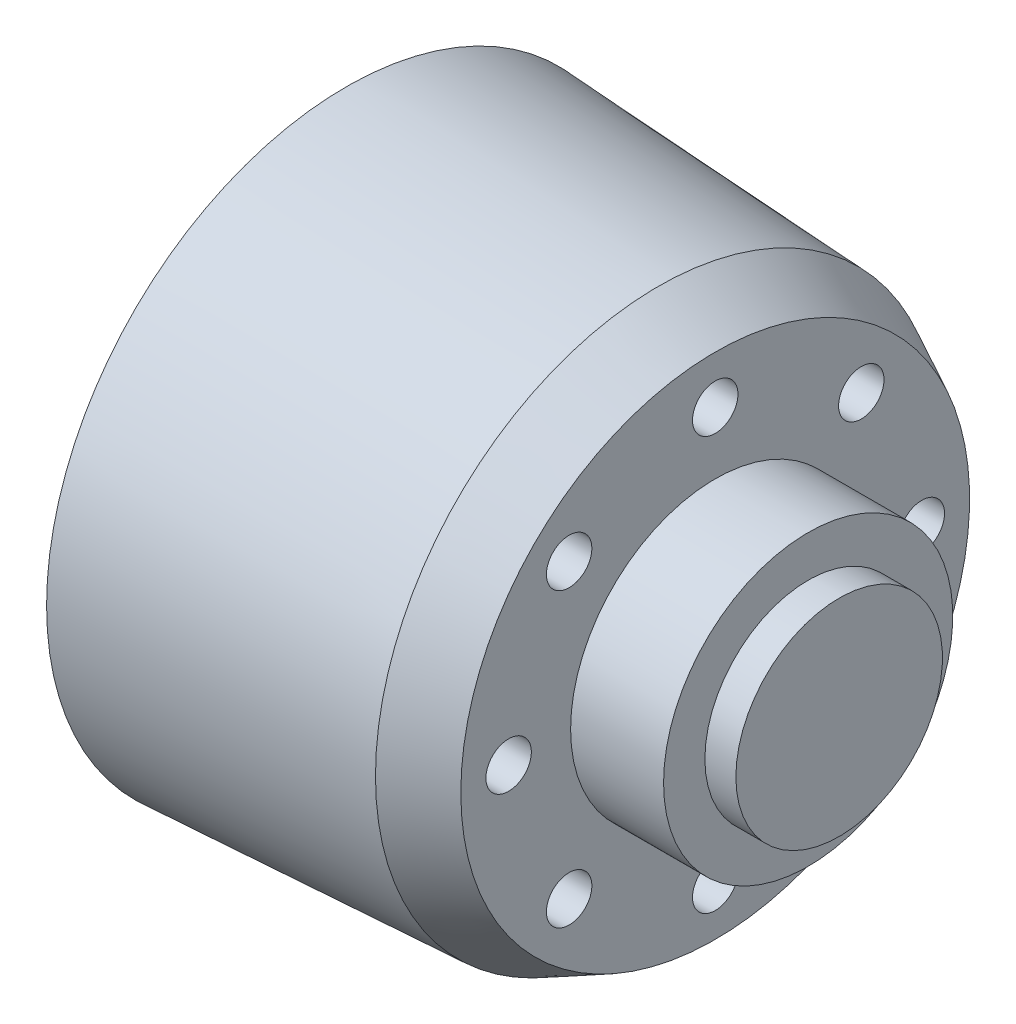
ISO-10303-21;
HEADER;
FILE_DESCRIPTION(('STEP AP214'),'2;1');
FILE_NAME('part.step','',(''),(''),'','','');
FILE_SCHEMA(('AUTOMOTIVE_DESIGN { 1 0 10303 214 1 1 1 1 }'));
ENDSEC;
DATA;
#1=APPLICATION_CONTEXT('core data for automotive mechanical design processes');
#2=APPLICATION_PROTOCOL_DEFINITION('international standard','automotive_design',2000,#1);
#3=PRODUCT_CONTEXT('',#1,'mechanical');
#4=PRODUCT('Part','Part','',(#3));
#5=PRODUCT_RELATED_PRODUCT_CATEGORY('part','',(#4));
#6=PRODUCT_DEFINITION_FORMATION('','',#4);
#7=PRODUCT_DEFINITION_CONTEXT('part definition',#1,'design');
#8=PRODUCT_DEFINITION('design','',#6,#7);
#9=PRODUCT_DEFINITION_SHAPE('','',#8);
#10=(LENGTH_UNIT() NAMED_UNIT(*) SI_UNIT(.MILLI.,.METRE.));
#11=(NAMED_UNIT(*) PLANE_ANGLE_UNIT() SI_UNIT($,.RADIAN.));
#12=(NAMED_UNIT(*) SI_UNIT($,.STERADIAN.) SOLID_ANGLE_UNIT());
#13=UNCERTAINTY_MEASURE_WITH_UNIT(LENGTH_MEASURE(1.E-05),#10,'distance_accuracy_value','');
#14=(GEOMETRIC_REPRESENTATION_CONTEXT(3) GLOBAL_UNCERTAINTY_ASSIGNED_CONTEXT((#13)) GLOBAL_UNIT_ASSIGNED_CONTEXT((#10,
#11,#12)) REPRESENTATION_CONTEXT('',''));
#15=CARTESIAN_POINT('',(0.,0.,0.));
#16=DIRECTION('',(0.,0.,1.));
#17=DIRECTION('',(1.,0.,0.));
#18=AXIS2_PLACEMENT_3D('',#15,#16,#17);
#19=CARTESIAN_POINT('',(-7.67303075194239,7.07106781186527,7.07106781186539));
#20=DIRECTION('',(1.,0.,0.));
#21=DIRECTION('',(0.,0.,-1.));
#22=AXIS2_PLACEMENT_3D('',#19,#20,#21);
#23=CYLINDRICAL_SURFACE('',#22,1.10000000000026);
#24=CARTESIAN_POINT('',(10.1938597161833,7.07106781186527,7.07106781186539));
#25=DIRECTION('',(1.,0.,0.));
#26=DIRECTION('',(0.,0.,-1.));
#27=AXIS2_PLACEMENT_3D('',#24,#25,#26);
#28=CIRCLE('',#27,1.10000000000026);
#29=CARTESIAN_POINT('',(10.1938597161833,7.07106781186527,5.97106781186514));
#30=VERTEX_POINT('',#29);
#31=EDGE_CURVE('E76',#30,#30,#28,.T.);
#32=ORIENTED_EDGE('',*,*,#31,.T.);
#33=EDGE_LOOP('',(#32));
#34=FACE_BOUND('',#33,.T.);
#35=CARTESIAN_POINT('',(7.19385971618328,7.07106781186527,7.07106781186539));
#36=DIRECTION('',(-1.,0.,0.));
#37=DIRECTION('',(0.,0.,1.));
#38=AXIS2_PLACEMENT_3D('',#35,#36,#37);
#39=CIRCLE('',#38,1.10000000000026);
#40=CARTESIAN_POINT('',(7.19385971618328,7.07106781186527,8.17106781186565));
#41=VERTEX_POINT('',#40);
#42=EDGE_CURVE('E40',#41,#41,#39,.F.);
#43=ORIENTED_EDGE('',*,*,#42,.F.);
#44=EDGE_LOOP('',(#43));
#45=FACE_BOUND('',#44,.T.);
#46=ADVANCED_FACE('F36',(#34,#45),#23,.F.);
#47=CARTESIAN_POINT('',(-7.67303075194239,-2.83604770904466E-13,9.99999999999972));
#48=DIRECTION('',(1.,0.,0.));
#49=DIRECTION('',(0.,0.,-1.));
#50=AXIS2_PLACEMENT_3D('',#47,#48,#49);
#51=CYLINDRICAL_SURFACE('',#50,1.10000000000045);
#52=CARTESIAN_POINT('',(10.1938597161833,-2.83604770904466E-13,9.99999999999972));
#53=DIRECTION('',(1.,0.,0.));
#54=DIRECTION('',(0.,0.,-1.));
#55=AXIS2_PLACEMENT_3D('',#52,#53,#54);
#56=CIRCLE('',#55,1.10000000000045);
#57=CARTESIAN_POINT('',(10.1938597161833,-2.83604770904466E-13,8.89999999999927));
#58=VERTEX_POINT('',#57);
#59=EDGE_CURVE('E80',#58,#58,#56,.T.);
#60=ORIENTED_EDGE('',*,*,#59,.T.);
#61=EDGE_LOOP('',(#60));
#62=FACE_BOUND('',#61,.T.);
#63=CARTESIAN_POINT('',(7.19385971618328,-2.83604770904466E-13,9.99999999999972));
#64=DIRECTION('',(-1.,0.,0.));
#65=DIRECTION('',(0.,0.,1.));
#66=AXIS2_PLACEMENT_3D('',#63,#64,#65);
#67=CIRCLE('',#66,1.10000000000045);
#68=CARTESIAN_POINT('',(7.19385971618328,-2.83604770904466E-13,11.1000000000002));
#69=VERTEX_POINT('',#68);
#70=EDGE_CURVE('E71',#69,#69,#67,.F.);
#71=ORIENTED_EDGE('',*,*,#70,.F.);
#72=EDGE_LOOP('',(#71));
#73=FACE_BOUND('',#72,.T.);
#74=ADVANCED_FACE('F141',(#62,#73),#51,.F.);
#75=CARTESIAN_POINT('',(-7.67303075194239,-7.07106781186568,7.07106781186499));
#76=DIRECTION('',(1.,0.,0.));
#77=DIRECTION('',(0.,0.,-1.));
#78=AXIS2_PLACEMENT_3D('',#75,#76,#77);
#79=CYLINDRICAL_SURFACE('',#78,1.1000000000006);
#80=CARTESIAN_POINT('',(10.1938597161833,-7.07106781186568,7.07106781186499));
#81=DIRECTION('',(1.,0.,0.));
#82=DIRECTION('',(0.,0.,-1.));
#83=AXIS2_PLACEMENT_3D('',#80,#81,#82);
#84=CIRCLE('',#83,1.1000000000006);
#85=CARTESIAN_POINT('',(10.1938597161833,-7.07106781186568,5.97106781186439));
#86=VERTEX_POINT('',#85);
#87=EDGE_CURVE('E85',#86,#86,#84,.T.);
#88=ORIENTED_EDGE('',*,*,#87,.T.);
#89=EDGE_LOOP('',(#88));
#90=FACE_BOUND('',#89,.T.);
#91=CARTESIAN_POINT('',(7.19385971618328,-7.07106781186568,7.07106781186499));
#92=DIRECTION('',(-1.,0.,0.));
#93=DIRECTION('',(0.,0.,1.));
#94=AXIS2_PLACEMENT_3D('',#91,#92,#93);
#95=CIRCLE('',#94,1.1000000000006);
#96=CARTESIAN_POINT('',(7.19385971618328,-7.07106781186568,8.1710678118656));
#97=VERTEX_POINT('',#96);
#98=EDGE_CURVE('E69',#97,#97,#95,.F.);
#99=ORIENTED_EDGE('',*,*,#98,.F.);
#100=EDGE_LOOP('',(#99));
#101=FACE_BOUND('',#100,.T.);
#102=ADVANCED_FACE('F146',(#90,#101),#79,.F.);
#103=CARTESIAN_POINT('',(-7.67303075194239,-10.,-5.64760248210638E-13));
#104=DIRECTION('',(1.,0.,0.));
#105=DIRECTION('',(0.,0.,-1.));
#106=AXIS2_PLACEMENT_3D('',#103,#104,#105);
#107=CYLINDRICAL_SURFACE('',#106,1.10000000000061);
#108=CARTESIAN_POINT('',(10.1938597161833,-10.,-5.64760248210638E-13));
#109=DIRECTION('',(1.,0.,0.));
#110=DIRECTION('',(0.,0.,-1.));
#111=AXIS2_PLACEMENT_3D('',#108,#109,#110);
#112=CIRCLE('',#111,1.10000000000061);
#113=CARTESIAN_POINT('',(10.1938597161833,-10.,-1.10000000000117));
#114=VERTEX_POINT('',#113);
#115=EDGE_CURVE('E477',#114,#114,#112,.T.);
#116=ORIENTED_EDGE('',*,*,#115,.T.);
#117=EDGE_LOOP('',(#116));
#118=FACE_BOUND('',#117,.T.);
#119=CARTESIAN_POINT('',(7.19385971618328,-10.,-5.64760248210638E-13));
#120=DIRECTION('',(-1.,0.,0.));
#121=DIRECTION('',(0.,0.,1.));
#122=AXIS2_PLACEMENT_3D('',#119,#120,#121);
#123=CIRCLE('',#122,1.10000000000061);
#124=CARTESIAN_POINT('',(7.19385971618328,-10.,1.10000000000004));
#125=VERTEX_POINT('',#124);
#126=EDGE_CURVE('E66',#125,#125,#123,.F.);
#127=ORIENTED_EDGE('',*,*,#126,.F.);
#128=EDGE_LOOP('',(#127));
#129=FACE_BOUND('',#128,.T.);
#130=ADVANCED_FACE('F346',(#118,#129),#107,.F.);
#131=CARTESIAN_POINT('',(-7.67303075194239,-7.07106781186527,-7.07106781186596));
#132=DIRECTION('',(1.,0.,0.));
#133=DIRECTION('',(0.,0.,-1.));
#134=AXIS2_PLACEMENT_3D('',#131,#132,#133);
#135=CYLINDRICAL_SURFACE('',#134,1.10000000000045);
#136=CARTESIAN_POINT('',(10.1938597161833,-7.07106781186527,-7.07106781186596));
#137=DIRECTION('',(1.,0.,0.));
#138=DIRECTION('',(0.,0.,-1.));
#139=AXIS2_PLACEMENT_3D('',#136,#137,#138);
#140=CIRCLE('',#139,1.10000000000045);
#141=CARTESIAN_POINT('',(10.1938597161833,-7.07106781186527,-8.17106781186641));
#142=VERTEX_POINT('',#141);
#143=EDGE_CURVE('E473',#142,#142,#140,.T.);
#144=ORIENTED_EDGE('',*,*,#143,.T.);
#145=EDGE_LOOP('',(#144));
#146=FACE_BOUND('',#145,.T.);
#147=CARTESIAN_POINT('',(7.19385971618328,-7.07106781186527,-7.07106781186596));
#148=DIRECTION('',(-1.,0.,0.));
#149=DIRECTION('',(0.,0.,1.));
#150=AXIS2_PLACEMENT_3D('',#147,#148,#149);
#151=CIRCLE('',#150,1.10000000000045);
#152=CARTESIAN_POINT('',(7.19385971618328,-7.07106781186527,-5.9710678118655));
#153=VERTEX_POINT('',#152);
#154=EDGE_CURVE('E63',#153,#153,#151,.F.);
#155=ORIENTED_EDGE('',*,*,#154,.F.);
#156=EDGE_LOOP('',(#155));
#157=FACE_BOUND('',#156,.T.);
#158=ADVANCED_FACE('F354',(#146,#157),#135,.F.);
#159=CARTESIAN_POINT('',(-7.67303075194239,2.82380124105319E-13,-10.0000000000003));
#160=DIRECTION('',(1.,0.,0.));
#161=DIRECTION('',(0.,0.,-1.));
#162=AXIS2_PLACEMENT_3D('',#159,#160,#161);
#163=CYLINDRICAL_SURFACE('',#162,1.10000000000022);
#164=CARTESIAN_POINT('',(10.1938597161833,2.82380124105319E-13,-10.0000000000003));
#165=DIRECTION('',(1.,0.,0.));
#166=DIRECTION('',(0.,0.,-1.));
#167=AXIS2_PLACEMENT_3D('',#164,#165,#166);
#168=CIRCLE('',#167,1.10000000000022);
#169=CARTESIAN_POINT('',(10.1938597161833,2.82380124105319E-13,-11.1000000000005));
#170=VERTEX_POINT('',#169);
#171=EDGE_CURVE('E469',#170,#170,#168,.T.);
#172=ORIENTED_EDGE('',*,*,#171,.T.);
#173=EDGE_LOOP('',(#172));
#174=FACE_BOUND('',#173,.T.);
#175=CARTESIAN_POINT('',(7.19385971618328,2.82380124105319E-13,-10.0000000000003));
#176=DIRECTION('',(-1.,0.,0.));
#177=DIRECTION('',(0.,0.,1.));
#178=AXIS2_PLACEMENT_3D('',#175,#176,#177);
#179=CIRCLE('',#178,1.10000000000022);
#180=CARTESIAN_POINT('',(7.19385971618328,2.82380124105319E-13,-8.90000000000006));
#181=VERTEX_POINT('',#180);
#182=EDGE_CURVE('E60',#181,#181,#179,.F.);
#183=ORIENTED_EDGE('',*,*,#182,.F.);
#184=EDGE_LOOP('',(#183));
#185=FACE_BOUND('',#184,.T.);
#186=ADVANCED_FACE('F363',(#174,#185),#163,.F.);
#187=CARTESIAN_POINT('',(-7.67303075194239,7.07106781186546,-7.07106781186549));
#188=DIRECTION('',(1.,0.,0.));
#189=DIRECTION('',(0.,0.,-1.));
#190=AXIS2_PLACEMENT_3D('',#187,#188,#189);
#191=CYLINDRICAL_SURFACE('',#190,1.1);
#192=CARTESIAN_POINT('',(10.1938597161833,7.07106781186546,-7.07106781186549));
#193=DIRECTION('',(1.,0.,0.));
#194=DIRECTION('',(0.,0.,-1.));
#195=AXIS2_PLACEMENT_3D('',#192,#193,#194);
#196=CIRCLE('',#195,1.1);
#197=CARTESIAN_POINT('',(10.1938597161833,7.07106781186546,-8.17106781186549));
#198=VERTEX_POINT('',#197);
#199=EDGE_CURVE('E465',#198,#198,#196,.T.);
#200=ORIENTED_EDGE('',*,*,#199,.T.);
#201=EDGE_LOOP('',(#200));
#202=FACE_BOUND('',#201,.T.);
#203=CARTESIAN_POINT('',(7.19385971618328,7.07106781186546,-7.07106781186549));
#204=DIRECTION('',(-1.,0.,0.));
#205=DIRECTION('',(0.,0.,1.));
#206=AXIS2_PLACEMENT_3D('',#203,#204,#205);
#207=CIRCLE('',#206,1.1);
#208=CARTESIAN_POINT('',(7.19385971618328,7.07106781186546,-5.97106781186549));
#209=VERTEX_POINT('',#208);
#210=EDGE_CURVE('E56',#209,#209,#207,.F.);
#211=ORIENTED_EDGE('',*,*,#210,.F.);
#212=EDGE_LOOP('',(#211));
#213=FACE_BOUND('',#212,.T.);
#214=ADVANCED_FACE('F372',(#202,#213),#191,.F.);
#215=CARTESIAN_POINT('',(-7.67303075194239,10.,0.));
#216=DIRECTION('',(1.,0.,0.));
#217=DIRECTION('',(0.,0.,-1.));
#218=AXIS2_PLACEMENT_3D('',#215,#216,#217);
#219=CYLINDRICAL_SURFACE('',#218,1.1);
#220=CARTESIAN_POINT('',(10.1938597161833,10.,0.));
#221=DIRECTION('',(1.,0.,0.));
#222=DIRECTION('',(0.,0.,-1.));
#223=AXIS2_PLACEMENT_3D('',#220,#221,#222);
#224=CIRCLE('',#223,1.1);
#225=CARTESIAN_POINT('',(10.1938597161833,10.,-1.1));
#226=VERTEX_POINT('',#225);
#227=EDGE_CURVE('E93',#226,#226,#224,.T.);
#228=ORIENTED_EDGE('',*,*,#227,.T.);
#229=EDGE_LOOP('',(#228));
#230=FACE_BOUND('',#229,.T.);
#231=CARTESIAN_POINT('',(7.19385971618328,10.,0.));
#232=DIRECTION('',(-1.,0.,0.));
#233=DIRECTION('',(0.,0.,1.));
#234=AXIS2_PLACEMENT_3D('',#231,#232,#233);
#235=CIRCLE('',#234,1.1);
#236=CARTESIAN_POINT('',(7.19385971618328,10.,1.1));
#237=VERTEX_POINT('',#236);
#238=EDGE_CURVE('E53',#237,#237,#235,.F.);
#239=ORIENTED_EDGE('',*,*,#238,.F.);
#240=EDGE_LOOP('',(#239));
#241=FACE_BOUND('',#240,.T.);
#242=ADVANCED_FACE('F381',(#230,#241),#219,.F.);
#243=CARTESIAN_POINT('',(7.43781635658242,0.,0.));
#244=DIRECTION('',(-1.,0.,0.));
#245=DIRECTION('',(0.,0.,1.));
#246=AXIS2_PLACEMENT_3D('',#243,#244,#245);
#247=CONICAL_SURFACE('',#246,13.69,0.0535526246495844);
#248=CARTESIAN_POINT('',(-7.67303075194239,0.,0.));
#249=DIRECTION('',(-1.,0.,0.));
#250=DIRECTION('',(0.,0.,1.));
#251=AXIS2_PLACEMENT_3D('',#248,#249,#250);
#252=CIRCLE('',#251,14.5);
#253=CARTESIAN_POINT('',(-7.67303075194239,0.,14.5));
#254=VERTEX_POINT('',#253);
#255=EDGE_CURVE('E96',#254,#254,#252,.T.);
#256=ORIENTED_EDGE('',*,*,#255,.F.);
#257=EDGE_LOOP('',(#256));
#258=FACE_BOUND('',#257,.T.);
#259=CARTESIAN_POINT('',(7.43781635658242,0.,0.));
#260=DIRECTION('',(-1.,0.,0.));
#261=DIRECTION('',(0.,0.,1.));
#262=AXIS2_PLACEMENT_3D('',#259,#260,#261);
#263=CIRCLE('',#262,13.69);
#264=CARTESIAN_POINT('',(7.43781635658242,0.,13.69));
#265=VERTEX_POINT('',#264);
#266=EDGE_CURVE('E11',#265,#265,#263,.T.);
#267=ORIENTED_EDGE('',*,*,#266,.T.);
#268=EDGE_LOOP('',(#267));
#269=FACE_BOUND('',#268,.T.);
#270=ADVANCED_FACE('F38',(#258,#269),#247,.T.);
#271=CARTESIAN_POINT('',(10.1938597161833,0.,0.));
#272=DIRECTION('',(-1.,0.,0.));
#273=DIRECTION('',(0.,0.,1.));
#274=AXIS2_PLACEMENT_3D('',#271,#272,#273);
#275=CONICAL_SURFACE('',#274,12.315,0.462770117792092);
#276=ORIENTED_EDGE('',*,*,#266,.F.);
#277=EDGE_LOOP('',(#276));
#278=FACE_BOUND('',#277,.T.);
#279=CARTESIAN_POINT('',(10.1938597161833,0.,0.));
#280=DIRECTION('',(-1.,0.,0.));
#281=DIRECTION('',(0.,0.,1.));
#282=AXIS2_PLACEMENT_3D('',#279,#280,#281);
#283=CIRCLE('',#282,12.315);
#284=CARTESIAN_POINT('',(10.1938597161833,0.,12.315));
#285=VERTEX_POINT('',#284);
#286=EDGE_CURVE('E44',#285,#285,#283,.T.);
#287=ORIENTED_EDGE('',*,*,#286,.T.);
#288=EDGE_LOOP('',(#287));
#289=FACE_BOUND('',#288,.T.);
#290=ADVANCED_FACE('F425',(#278,#289),#275,.T.);
#291=CARTESIAN_POINT('',(10.1938597161833,0.,-12.315));
#292=DIRECTION('',(-1.,0.,0.));
#293=DIRECTION('',(0.,0.,1.));
#294=AXIS2_PLACEMENT_3D('',#291,#292,#293);
#295=PLANE('',#294);
#296=ORIENTED_EDGE('',*,*,#227,.F.);
#297=EDGE_LOOP('',(#296));
#298=FACE_BOUND('',#297,.T.);
#299=ORIENTED_EDGE('',*,*,#199,.F.);
#300=EDGE_LOOP('',(#299));
#301=FACE_BOUND('',#300,.T.);
#302=ORIENTED_EDGE('',*,*,#171,.F.);
#303=EDGE_LOOP('',(#302));
#304=FACE_BOUND('',#303,.T.);
#305=ORIENTED_EDGE('',*,*,#143,.F.);
#306=EDGE_LOOP('',(#305));
#307=FACE_BOUND('',#306,.T.);
#308=ORIENTED_EDGE('',*,*,#115,.F.);
#309=EDGE_LOOP('',(#308));
#310=FACE_BOUND('',#309,.T.);
#311=ORIENTED_EDGE('',*,*,#87,.F.);
#312=EDGE_LOOP('',(#311));
#313=FACE_BOUND('',#312,.T.);
#314=ORIENTED_EDGE('',*,*,#59,.F.);
#315=EDGE_LOOP('',(#314));
#316=FACE_BOUND('',#315,.T.);
#317=ORIENTED_EDGE('',*,*,#31,.F.);
#318=EDGE_LOOP('',(#317));
#319=FACE_BOUND('',#318,.T.);
#320=ORIENTED_EDGE('',*,*,#286,.F.);
#321=EDGE_LOOP('',(#320));
#322=FACE_BOUND('',#321,.T.);
#323=CARTESIAN_POINT('',(10.1938597161833,0.,0.));
#324=DIRECTION('',(-1.,0.,0.));
#325=DIRECTION('',(0.,0.,1.));
#326=AXIS2_PLACEMENT_3D('',#323,#324,#325);
#327=CIRCLE('',#326,7.);
#328=CARTESIAN_POINT('',(10.1938597161833,0.,7.));
#329=VERTEX_POINT('',#328);
#330=EDGE_CURVE('E49',#329,#329,#327,.T.);
#331=ORIENTED_EDGE('',*,*,#330,.T.);
#332=EDGE_LOOP('',(#331));
#333=FACE_BOUND('',#332,.T.);
#334=ADVANCED_FACE('F110',(#298,#301,#304,#307,#310,#313,#316,#319,#322,#333),#295,.F.);
#335=CARTESIAN_POINT('',(-18.2337662337662,0.,0.));
#336=DIRECTION('',(-1.,0.,0.));
#337=DIRECTION('',(0.,0.,1.));
#338=AXIS2_PLACEMENT_3D('',#335,#336,#337);
#339=CYLINDRICAL_SURFACE('',#338,7.);
#340=ORIENTED_EDGE('',*,*,#330,.F.);
#341=EDGE_LOOP('',(#340));
#342=FACE_BOUND('',#341,.T.);
#343=CARTESIAN_POINT('',(14.6938597161833,0.,0.));
#344=DIRECTION('',(-1.,0.,0.));
#345=DIRECTION('',(0.,0.,1.));
#346=AXIS2_PLACEMENT_3D('',#343,#344,#345);
#347=CIRCLE('',#346,7.);
#348=CARTESIAN_POINT('',(14.6938597161833,0.,7.));
#349=VERTEX_POINT('',#348);
#350=EDGE_CURVE('E105',#349,#349,#347,.T.);
#351=ORIENTED_EDGE('',*,*,#350,.T.);
#352=EDGE_LOOP('',(#351));
#353=FACE_BOUND('',#352,.T.);
#354=ADVANCED_FACE('F112',(#342,#353),#339,.T.);
#355=CARTESIAN_POINT('',(14.6938597161833,0.,-7.));
#356=DIRECTION('',(-1.,0.,0.));
#357=DIRECTION('',(0.,0.,1.));
#358=AXIS2_PLACEMENT_3D('',#355,#356,#357);
#359=PLANE('',#358);
#360=ORIENTED_EDGE('',*,*,#350,.F.);
#361=EDGE_LOOP('',(#360));
#362=FACE_BOUND('',#361,.T.);
#363=CARTESIAN_POINT('',(14.6938597161833,0.,0.));
#364=DIRECTION('',(-1.,0.,0.));
#365=DIRECTION('',(0.,0.,1.));
#366=AXIS2_PLACEMENT_3D('',#363,#364,#365);
#367=CIRCLE('',#366,5.);
#368=CARTESIAN_POINT('',(14.6938597161833,0.,5.));
#369=VERTEX_POINT('',#368);
#370=EDGE_CURVE('E102',#369,#369,#367,.T.);
#371=ORIENTED_EDGE('',*,*,#370,.T.);
#372=EDGE_LOOP('',(#371));
#373=FACE_BOUND('',#372,.T.);
#374=ADVANCED_FACE('F115',(#362,#373),#359,.F.);
#375=CARTESIAN_POINT('',(-18.2337662337662,0.,0.));
#376=DIRECTION('',(-1.,0.,0.));
#377=DIRECTION('',(0.,0.,1.));
#378=AXIS2_PLACEMENT_3D('',#375,#376,#377);
#379=CYLINDRICAL_SURFACE('',#378,5.);
#380=ORIENTED_EDGE('',*,*,#370,.F.);
#381=EDGE_LOOP('',(#380));
#382=FACE_BOUND('',#381,.T.);
#383=CARTESIAN_POINT('',(16.1938597161833,0.,0.));
#384=DIRECTION('',(-1.,0.,0.));
#385=DIRECTION('',(0.,0.,1.));
#386=AXIS2_PLACEMENT_3D('',#383,#384,#385);
#387=CIRCLE('',#386,5.);
#388=CARTESIAN_POINT('',(16.1938597161833,0.,5.));
#389=VERTEX_POINT('',#388);
#390=EDGE_CURVE('E99',#389,#389,#387,.T.);
#391=ORIENTED_EDGE('',*,*,#390,.T.);
#392=EDGE_LOOP('',(#391));
#393=FACE_BOUND('',#392,.T.);
#394=ADVANCED_FACE('F121',(#382,#393),#379,.T.);
#395=CARTESIAN_POINT('',(16.1938597161833,0.,-5.));
#396=DIRECTION('',(-1.,0.,0.));
#397=DIRECTION('',(0.,0.,1.));
#398=AXIS2_PLACEMENT_3D('',#395,#396,#397);
#399=PLANE('',#398);
#400=ORIENTED_EDGE('',*,*,#390,.F.);
#401=EDGE_LOOP('',(#400));
#402=FACE_BOUND('',#401,.T.);
#403=ADVANCED_FACE('F127',(#402),#399,.F.);
#404=CARTESIAN_POINT('',(-7.67303075194239,0.,0.));
#405=DIRECTION('',(1.,0.,0.));
#406=DIRECTION('',(0.,0.,-1.));
#407=AXIS2_PLACEMENT_3D('',#404,#405,#406);
#408=PLANE('',#407);
#409=CARTESIAN_POINT('',(-7.67303075194239,7.07106781186517,-7.07106781186535));
#410=DIRECTION('',(-1.,0.,0.));
#411=DIRECTION('',(0.,0.,1.));
#412=AXIS2_PLACEMENT_3D('',#409,#410,#411);
#413=CIRCLE('',#412,2.50000000000033);
#414=CARTESIAN_POINT('',(-7.67303075194239,7.07106781186517,-4.57106781186503));
#415=VERTEX_POINT('',#414);
#416=EDGE_CURVE('E500',#415,#415,#413,.T.);
#417=ORIENTED_EDGE('',*,*,#416,.F.);
#418=EDGE_LOOP('',(#417));
#419=FACE_BOUND('',#418,.T.);
#420=CARTESIAN_POINT('',(-7.67303075194239,-4.25713318056486E-13,-9.99999999999958));
#421=DIRECTION('',(-1.,0.,0.));
#422=DIRECTION('',(0.,0.,1.));
#423=AXIS2_PLACEMENT_3D('',#420,#421,#422);
#424=CIRCLE('',#423,2.50000000000063);
#425=CARTESIAN_POINT('',(-7.67303075194239,-4.25713318056486E-13,-7.49999999999895));
#426=VERTEX_POINT('',#425);
#427=EDGE_CURVE('E499',#426,#426,#424,.T.);
#428=ORIENTED_EDGE('',*,*,#427,.F.);
#429=EDGE_LOOP('',(#428));
#430=FACE_BOUND('',#429,.T.);
#431=CARTESIAN_POINT('',(-7.67303075194239,-7.07106781186578,-7.07106781186475));
#432=DIRECTION('',(-1.,0.,0.));
#433=DIRECTION('',(0.,0.,1.));
#434=AXIS2_PLACEMENT_3D('',#431,#432,#433);
#435=CIRCLE('',#434,2.50000000000086);
#436=CARTESIAN_POINT('',(-7.67303075194239,-7.07106781186578,-4.57106781186389));
#437=VERTEX_POINT('',#436);
#438=EDGE_CURVE('E506',#437,#437,#435,.T.);
#439=ORIENTED_EDGE('',*,*,#438,.F.);
#440=EDGE_LOOP('',(#439));
#441=FACE_BOUND('',#440,.T.);
#442=CARTESIAN_POINT('',(-7.67303075194239,-10.,8.48977342514678E-13));
#443=DIRECTION('',(-1.,0.,0.));
#444=DIRECTION('',(0.,0.,1.));
#445=AXIS2_PLACEMENT_3D('',#442,#443,#444);
#446=CIRCLE('',#445,2.50000000000088);
#447=CARTESIAN_POINT('',(-7.67303075194239,-10.,2.50000000000173));
#448=VERTEX_POINT('',#447);
#449=EDGE_CURVE('E512',#448,#448,#446,.T.);
#450=ORIENTED_EDGE('',*,*,#449,.F.);
#451=EDGE_LOOP('',(#450));
#452=FACE_BOUND('',#451,.T.);
#453=CARTESIAN_POINT('',(-7.67303075194239,-7.07106781186517,7.0710678118662));
#454=DIRECTION('',(-1.,0.,0.));
#455=DIRECTION('',(0.,0.,1.));
#456=AXIS2_PLACEMENT_3D('',#453,#454,#455);
#457=CIRCLE('',#456,2.50000000000066);
#458=CARTESIAN_POINT('',(-7.67303075194239,-7.07106781186517,9.57106781186686));
#459=VERTEX_POINT('',#458);
#460=EDGE_CURVE('E518',#459,#459,#457,.T.);
#461=ORIENTED_EDGE('',*,*,#460,.F.);
#462=EDGE_LOOP('',(#461));
#463=FACE_BOUND('',#462,.T.);
#464=CARTESIAN_POINT('',(-7.67303075194239,4.24488671257339E-13,10.0000000000004));
#465=DIRECTION('',(-1.,0.,0.));
#466=DIRECTION('',(0.,0.,1.));
#467=AXIS2_PLACEMENT_3D('',#464,#465,#466);
#468=CIRCLE('',#467,2.50000000000032);
#469=CARTESIAN_POINT('',(-7.67303075194239,4.24488671257339E-13,12.5000000000007));
#470=VERTEX_POINT('',#469);
#471=EDGE_CURVE('E524',#470,#470,#468,.T.);
#472=ORIENTED_EDGE('',*,*,#471,.F.);
#473=EDGE_LOOP('',(#472));
#474=FACE_BOUND('',#473,.T.);
#475=CARTESIAN_POINT('',(-7.67303075194239,7.07106781186578,7.0710678118656));
#476=DIRECTION('',(-1.,0.,0.));
#477=DIRECTION('',(0.,0.,1.));
#478=AXIS2_PLACEMENT_3D('',#475,#476,#477);
#479=CIRCLE('',#478,2.50000000000005);
#480=CARTESIAN_POINT('',(-7.67303075194239,7.07106781186578,9.57106781186565));
#481=VERTEX_POINT('',#480);
#482=EDGE_CURVE('E530',#481,#481,#479,.T.);
#483=ORIENTED_EDGE('',*,*,#482,.F.);
#484=EDGE_LOOP('',(#483));
#485=FACE_BOUND('',#484,.T.);
#486=CARTESIAN_POINT('',(-7.67303075194239,10.,0.));
#487=DIRECTION('',(-1.,0.,0.));
#488=DIRECTION('',(0.,0.,1.));
#489=AXIS2_PLACEMENT_3D('',#486,#487,#488);
#490=CIRCLE('',#489,2.5);
#491=CARTESIAN_POINT('',(-7.67303075194239,10.,2.5));
#492=VERTEX_POINT('',#491);
#493=EDGE_CURVE('E492',#492,#492,#490,.T.);
#494=ORIENTED_EDGE('',*,*,#493,.F.);
#495=EDGE_LOOP('',(#494));
#496=FACE_BOUND('',#495,.T.);
#497=CARTESIAN_POINT('',(-7.67303075194239,0.,0.));
#498=DIRECTION('',(-1.,0.,0.));
#499=DIRECTION('',(0.,0.,1.));
#500=AXIS2_PLACEMENT_3D('',#497,#498,#499);
#501=CIRCLE('',#500,4.45);
#502=CARTESIAN_POINT('',(-7.67303075194239,0.,4.45));
#503=VERTEX_POINT('',#502);
#504=EDGE_CURVE('E89',#503,#503,#501,.T.);
#505=ORIENTED_EDGE('',*,*,#504,.F.);
#506=EDGE_LOOP('',(#505));
#507=FACE_BOUND('',#506,.T.);
#508=ORIENTED_EDGE('',*,*,#255,.T.);
#509=EDGE_LOOP('',(#508));
#510=FACE_BOUND('',#509,.T.);
#511=ADVANCED_FACE('F132',(#419,#430,#441,#452,#463,#474,#485,#496,#507,#510),#408,.F.);
#512=CARTESIAN_POINT('',(-0.673030751942387,0.,0.));
#513=DIRECTION('',(1.,0.,0.));
#514=DIRECTION('',(0.,0.,-1.));
#515=AXIS2_PLACEMENT_3D('',#512,#513,#514);
#516=PLANE('',#515);
#517=CARTESIAN_POINT('',(-0.673030751942388,0.,0.));
#518=DIRECTION('',(1.,0.,0.));
#519=DIRECTION('',(0.,0.,-1.));
#520=AXIS2_PLACEMENT_3D('',#517,#518,#519);
#521=CIRCLE('',#520,4.45);
#522=CARTESIAN_POINT('',(-0.673030751942388,0.,-4.45));
#523=VERTEX_POINT('',#522);
#524=EDGE_CURVE('E92',#523,#523,#521,.F.);
#525=ORIENTED_EDGE('',*,*,#524,.T.);
#526=EDGE_LOOP('',(#525));
#527=FACE_BOUND('',#526,.T.);
#528=ADVANCED_FACE('F137',(#527),#516,.F.);
#529=CARTESIAN_POINT('',(18.9134699531782,0.,0.));
#530=DIRECTION('',(-1.,0.,0.));
#531=DIRECTION('',(0.,0.,1.));
#532=AXIS2_PLACEMENT_3D('',#529,#530,#531);
#533=CYLINDRICAL_SURFACE('',#532,4.45);
#534=ORIENTED_EDGE('',*,*,#504,.T.);
#535=EDGE_LOOP('',(#534));
#536=FACE_BOUND('',#535,.T.);
#537=ORIENTED_EDGE('',*,*,#524,.F.);
#538=EDGE_LOOP('',(#537));
#539=FACE_BOUND('',#538,.T.);
#540=ADVANCED_FACE('F152',(#536,#539),#533,.F.);
#541=CARTESIAN_POINT('',(7.19385971618328,0.,-12.315));
#542=DIRECTION('',(-1.,0.,0.));
#543=DIRECTION('',(0.,0.,1.));
#544=AXIS2_PLACEMENT_3D('',#541,#542,#543);
#545=PLANE('',#544);
#546=CARTESIAN_POINT('',(7.19385971618328,10.,0.));
#547=DIRECTION('',(-1.,0.,0.));
#548=DIRECTION('',(0.,0.,1.));
#549=AXIS2_PLACEMENT_3D('',#546,#547,#548);
#550=CIRCLE('',#549,2.5);
#551=CARTESIAN_POINT('',(7.19385971618328,10.,2.5));
#552=VERTEX_POINT('',#551);
#553=EDGE_CURVE('E57',#552,#552,#550,.F.);
#554=ORIENTED_EDGE('',*,*,#553,.F.);
#555=EDGE_LOOP('',(#554));
#556=FACE_BOUND('',#555,.T.);
#557=ORIENTED_EDGE('',*,*,#238,.T.);
#558=EDGE_LOOP('',(#557));
#559=FACE_BOUND('',#558,.T.);
#560=ADVANCED_FACE('F155',(#556,#559),#545,.T.);
#561=CARTESIAN_POINT('',(17.2649275280512,10.,0.));
#562=DIRECTION('',(-1.,0.,0.));
#563=DIRECTION('',(0.,0.,1.));
#564=AXIS2_PLACEMENT_3D('',#561,#562,#563);
#565=CYLINDRICAL_SURFACE('',#564,2.5);
#566=ORIENTED_EDGE('',*,*,#553,.T.);
#567=EDGE_LOOP('',(#566));
#568=FACE_BOUND('',#567,.T.);
#569=ORIENTED_EDGE('',*,*,#493,.T.);
#570=EDGE_LOOP('',(#569));
#571=FACE_BOUND('',#570,.T.);
#572=ADVANCED_FACE('F176',(#568,#571),#565,.F.);
#573=CARTESIAN_POINT('',(7.19385971618328,0.,-12.315));
#574=DIRECTION('',(-1.,0.,0.));
#575=DIRECTION('',(0.,0.,1.));
#576=AXIS2_PLACEMENT_3D('',#573,#574,#575);
#577=PLANE('',#576);
#578=CARTESIAN_POINT('',(7.19385971618328,7.07106781186517,-7.07106781186535));
#579=DIRECTION('',(-1.,0.,0.));
#580=DIRECTION('',(0.,0.,1.));
#581=AXIS2_PLACEMENT_3D('',#578,#579,#580);
#582=CIRCLE('',#581,2.50000000000033);
#583=CARTESIAN_POINT('',(7.19385971618328,7.07106781186517,-4.57106781186503));
#584=VERTEX_POINT('',#583);
#585=EDGE_CURVE('E496',#584,#584,#582,.F.);
#586=ORIENTED_EDGE('',*,*,#585,.F.);
#587=EDGE_LOOP('',(#586));
#588=FACE_BOUND('',#587,.T.);
#589=ORIENTED_EDGE('',*,*,#210,.T.);
#590=EDGE_LOOP('',(#589));
#591=FACE_BOUND('',#590,.T.);
#592=ADVANCED_FACE('F184',(#588,#591),#577,.T.);
#593=CARTESIAN_POINT('',(17.2649275280512,7.07106781186517,-7.07106781186535));
#594=DIRECTION('',(-1.,0.,0.));
#595=DIRECTION('',(0.,0.,1.));
#596=AXIS2_PLACEMENT_3D('',#593,#594,#595);
#597=CYLINDRICAL_SURFACE('',#596,2.50000000000033);
#598=ORIENTED_EDGE('',*,*,#585,.T.);
#599=EDGE_LOOP('',(#598));
#600=FACE_BOUND('',#599,.T.);
#601=ORIENTED_EDGE('',*,*,#416,.T.);
#602=EDGE_LOOP('',(#601));
#603=FACE_BOUND('',#602,.T.);
#604=ADVANCED_FACE('F192',(#600,#603),#597,.F.);
#605=CARTESIAN_POINT('',(7.19385971618328,0.,-12.315));
#606=DIRECTION('',(-1.,0.,0.));
#607=DIRECTION('',(0.,0.,1.));
#608=AXIS2_PLACEMENT_3D('',#605,#606,#607);
#609=PLANE('',#608);
#610=CARTESIAN_POINT('',(7.19385971618328,-4.25713318056486E-13,-9.99999999999958));
#611=DIRECTION('',(-1.,0.,0.));
#612=DIRECTION('',(0.,0.,1.));
#613=AXIS2_PLACEMENT_3D('',#610,#611,#612);
#614=CIRCLE('',#613,2.50000000000063);
#615=CARTESIAN_POINT('',(7.19385971618328,-4.25713318056486E-13,-7.49999999999895));
#616=VERTEX_POINT('',#615);
#617=EDGE_CURVE('E503',#616,#616,#614,.F.);
#618=ORIENTED_EDGE('',*,*,#617,.F.);
#619=EDGE_LOOP('',(#618));
#620=FACE_BOUND('',#619,.T.);
#621=ORIENTED_EDGE('',*,*,#182,.T.);
#622=EDGE_LOOP('',(#621));
#623=FACE_BOUND('',#622,.T.);
#624=ADVANCED_FACE('F200',(#620,#623),#609,.T.);
#625=CARTESIAN_POINT('',(17.2649275280512,-4.25713318056486E-13,-9.99999999999958));
#626=DIRECTION('',(-1.,0.,0.));
#627=DIRECTION('',(0.,0.,1.));
#628=AXIS2_PLACEMENT_3D('',#625,#626,#627);
#629=CYLINDRICAL_SURFACE('',#628,2.50000000000063);
#630=ORIENTED_EDGE('',*,*,#617,.T.);
#631=EDGE_LOOP('',(#630));
#632=FACE_BOUND('',#631,.T.);
#633=ORIENTED_EDGE('',*,*,#427,.T.);
#634=EDGE_LOOP('',(#633));
#635=FACE_BOUND('',#634,.T.);
#636=ADVANCED_FACE('F208',(#632,#635),#629,.F.);
#637=CARTESIAN_POINT('',(7.19385971618328,0.,-12.315));
#638=DIRECTION('',(-1.,0.,0.));
#639=DIRECTION('',(0.,0.,1.));
#640=AXIS2_PLACEMENT_3D('',#637,#638,#639);
#641=PLANE('',#640);
#642=CARTESIAN_POINT('',(7.19385971618328,-7.07106781186578,-7.07106781186475));
#643=DIRECTION('',(-1.,0.,0.));
#644=DIRECTION('',(0.,0.,1.));
#645=AXIS2_PLACEMENT_3D('',#642,#643,#644);
#646=CIRCLE('',#645,2.50000000000086);
#647=CARTESIAN_POINT('',(7.19385971618328,-7.07106781186578,-4.57106781186389));
#648=VERTEX_POINT('',#647);
#649=EDGE_CURVE('E509',#648,#648,#646,.F.);
#650=ORIENTED_EDGE('',*,*,#649,.F.);
#651=EDGE_LOOP('',(#650));
#652=FACE_BOUND('',#651,.T.);
#653=ORIENTED_EDGE('',*,*,#154,.T.);
#654=EDGE_LOOP('',(#653));
#655=FACE_BOUND('',#654,.T.);
#656=ADVANCED_FACE('F216',(#652,#655),#641,.T.);
#657=CARTESIAN_POINT('',(17.2649275280512,-7.07106781186578,-7.07106781186475));
#658=DIRECTION('',(-1.,0.,0.));
#659=DIRECTION('',(0.,0.,1.));
#660=AXIS2_PLACEMENT_3D('',#657,#658,#659);
#661=CYLINDRICAL_SURFACE('',#660,2.50000000000086);
#662=ORIENTED_EDGE('',*,*,#649,.T.);
#663=EDGE_LOOP('',(#662));
#664=FACE_BOUND('',#663,.T.);
#665=ORIENTED_EDGE('',*,*,#438,.T.);
#666=EDGE_LOOP('',(#665));
#667=FACE_BOUND('',#666,.T.);
#668=ADVANCED_FACE('F224',(#664,#667),#661,.F.);
#669=CARTESIAN_POINT('',(7.19385971618328,0.,-12.315));
#670=DIRECTION('',(-1.,0.,0.));
#671=DIRECTION('',(0.,0.,1.));
#672=AXIS2_PLACEMENT_3D('',#669,#670,#671);
#673=PLANE('',#672);
#674=CARTESIAN_POINT('',(7.19385971618328,-10.,8.48977342514678E-13));
#675=DIRECTION('',(-1.,0.,0.));
#676=DIRECTION('',(0.,0.,1.));
#677=AXIS2_PLACEMENT_3D('',#674,#675,#676);
#678=CIRCLE('',#677,2.50000000000088);
#679=CARTESIAN_POINT('',(7.19385971618328,-10.,2.50000000000173));
#680=VERTEX_POINT('',#679);
#681=EDGE_CURVE('E515',#680,#680,#678,.F.);
#682=ORIENTED_EDGE('',*,*,#681,.F.);
#683=EDGE_LOOP('',(#682));
#684=FACE_BOUND('',#683,.T.);
#685=ORIENTED_EDGE('',*,*,#126,.T.);
#686=EDGE_LOOP('',(#685));
#687=FACE_BOUND('',#686,.T.);
#688=ADVANCED_FACE('F232',(#684,#687),#673,.T.);
#689=CARTESIAN_POINT('',(17.2649275280512,-10.,8.48977342514678E-13));
#690=DIRECTION('',(-1.,0.,0.));
#691=DIRECTION('',(0.,0.,1.));
#692=AXIS2_PLACEMENT_3D('',#689,#690,#691);
#693=CYLINDRICAL_SURFACE('',#692,2.50000000000088);
#694=ORIENTED_EDGE('',*,*,#681,.T.);
#695=EDGE_LOOP('',(#694));
#696=FACE_BOUND('',#695,.T.);
#697=ORIENTED_EDGE('',*,*,#449,.T.);
#698=EDGE_LOOP('',(#697));
#699=FACE_BOUND('',#698,.T.);
#700=ADVANCED_FACE('F240',(#696,#699),#693,.F.);
#701=CARTESIAN_POINT('',(7.19385971618328,0.,-12.315));
#702=DIRECTION('',(-1.,0.,0.));
#703=DIRECTION('',(0.,0.,1.));
#704=AXIS2_PLACEMENT_3D('',#701,#702,#703);
#705=PLANE('',#704);
#706=CARTESIAN_POINT('',(7.19385971618328,-7.07106781186517,7.0710678118662));
#707=DIRECTION('',(-1.,0.,0.));
#708=DIRECTION('',(0.,0.,1.));
#709=AXIS2_PLACEMENT_3D('',#706,#707,#708);
#710=CIRCLE('',#709,2.50000000000066);
#711=CARTESIAN_POINT('',(7.19385971618328,-7.07106781186517,9.57106781186686));
#712=VERTEX_POINT('',#711);
#713=EDGE_CURVE('E521',#712,#712,#710,.F.);
#714=ORIENTED_EDGE('',*,*,#713,.F.);
#715=EDGE_LOOP('',(#714));
#716=FACE_BOUND('',#715,.T.);
#717=ORIENTED_EDGE('',*,*,#98,.T.);
#718=EDGE_LOOP('',(#717));
#719=FACE_BOUND('',#718,.T.);
#720=ADVANCED_FACE('F248',(#716,#719),#705,.T.);
#721=CARTESIAN_POINT('',(17.2649275280512,-7.07106781186517,7.0710678118662));
#722=DIRECTION('',(-1.,0.,0.));
#723=DIRECTION('',(0.,0.,1.));
#724=AXIS2_PLACEMENT_3D('',#721,#722,#723);
#725=CYLINDRICAL_SURFACE('',#724,2.50000000000066);
#726=ORIENTED_EDGE('',*,*,#713,.T.);
#727=EDGE_LOOP('',(#726));
#728=FACE_BOUND('',#727,.T.);
#729=ORIENTED_EDGE('',*,*,#460,.T.);
#730=EDGE_LOOP('',(#729));
#731=FACE_BOUND('',#730,.T.);
#732=ADVANCED_FACE('F256',(#728,#731),#725,.F.);
#733=CARTESIAN_POINT('',(7.19385971618328,0.,-12.315));
#734=DIRECTION('',(-1.,0.,0.));
#735=DIRECTION('',(0.,0.,1.));
#736=AXIS2_PLACEMENT_3D('',#733,#734,#735);
#737=PLANE('',#736);
#738=CARTESIAN_POINT('',(7.19385971618328,4.24488671257339E-13,10.0000000000004));
#739=DIRECTION('',(-1.,0.,0.));
#740=DIRECTION('',(0.,0.,1.));
#741=AXIS2_PLACEMENT_3D('',#738,#739,#740);
#742=CIRCLE('',#741,2.50000000000032);
#743=CARTESIAN_POINT('',(7.19385971618328,4.24488671257339E-13,12.5000000000007));
#744=VERTEX_POINT('',#743);
#745=EDGE_CURVE('E527',#744,#744,#742,.F.);
#746=ORIENTED_EDGE('',*,*,#745,.F.);
#747=EDGE_LOOP('',(#746));
#748=FACE_BOUND('',#747,.T.);
#749=ORIENTED_EDGE('',*,*,#70,.T.);
#750=EDGE_LOOP('',(#749));
#751=FACE_BOUND('',#750,.T.);
#752=ADVANCED_FACE('F264',(#748,#751),#737,.T.);
#753=CARTESIAN_POINT('',(17.2649275280512,4.24488671257339E-13,10.0000000000004));
#754=DIRECTION('',(-1.,0.,0.));
#755=DIRECTION('',(0.,0.,1.));
#756=AXIS2_PLACEMENT_3D('',#753,#754,#755);
#757=CYLINDRICAL_SURFACE('',#756,2.50000000000032);
#758=ORIENTED_EDGE('',*,*,#745,.T.);
#759=EDGE_LOOP('',(#758));
#760=FACE_BOUND('',#759,.T.);
#761=ORIENTED_EDGE('',*,*,#471,.T.);
#762=EDGE_LOOP('',(#761));
#763=FACE_BOUND('',#762,.T.);
#764=ADVANCED_FACE('F272',(#760,#763),#757,.F.);
#765=CARTESIAN_POINT('',(7.19385971618328,0.,-12.315));
#766=DIRECTION('',(-1.,0.,0.));
#767=DIRECTION('',(0.,0.,1.));
#768=AXIS2_PLACEMENT_3D('',#765,#766,#767);
#769=PLANE('',#768);
#770=CARTESIAN_POINT('',(7.19385971618328,7.07106781186578,7.0710678118656));
#771=DIRECTION('',(-1.,0.,0.));
#772=DIRECTION('',(0.,0.,1.));
#773=AXIS2_PLACEMENT_3D('',#770,#771,#772);
#774=CIRCLE('',#773,2.50000000000005);
#775=CARTESIAN_POINT('',(7.19385971618328,7.07106781186578,9.57106781186565));
#776=VERTEX_POINT('',#775);
#777=EDGE_CURVE('E495',#776,#776,#774,.F.);
#778=ORIENTED_EDGE('',*,*,#777,.F.);
#779=EDGE_LOOP('',(#778));
#780=FACE_BOUND('',#779,.T.);
#781=ORIENTED_EDGE('',*,*,#42,.T.);
#782=EDGE_LOOP('',(#781));
#783=FACE_BOUND('',#782,.T.);
#784=ADVANCED_FACE('F280',(#780,#783),#769,.T.);
#785=CARTESIAN_POINT('',(17.2649275280512,7.07106781186578,7.0710678118656));
#786=DIRECTION('',(-1.,0.,0.));
#787=DIRECTION('',(0.,0.,1.));
#788=AXIS2_PLACEMENT_3D('',#785,#786,#787);
#789=CYLINDRICAL_SURFACE('',#788,2.50000000000005);
#790=ORIENTED_EDGE('',*,*,#777,.T.);
#791=EDGE_LOOP('',(#790));
#792=FACE_BOUND('',#791,.T.);
#793=ORIENTED_EDGE('',*,*,#482,.T.);
#794=EDGE_LOOP('',(#793));
#795=FACE_BOUND('',#794,.T.);
#796=ADVANCED_FACE('F288',(#792,#795),#789,.F.);
#797=CLOSED_SHELL('',(#46,#74,#102,#130,#158,#186,#214,#242,#270,#290,#334,#354,#374,#394,#403,
#511,#528,#540,#560,#572,#592,#604,#624,#636,#656,#668,#688,#700,#720,#732,#752,#764,#784,#796));
#798=MANIFOLD_SOLID_BREP('B2',#797);
#799=ADVANCED_BREP_SHAPE_REPRESENTATION('',(#18,#798),#14);
#800=SHAPE_DEFINITION_REPRESENTATION(#9,#799);
ENDSEC;
END-ISO-10303-21;
